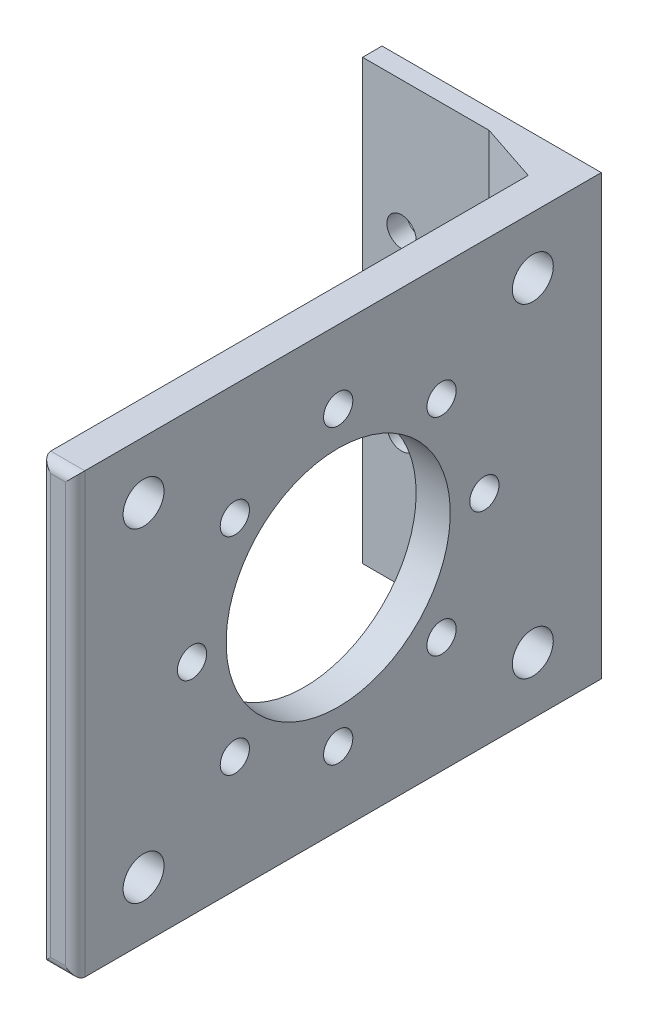
ISO-10303-21;
HEADER;
FILE_DESCRIPTION(('STEP AP214'),'2;1');
FILE_NAME('part.step','',(''),(''),'','','');
FILE_SCHEMA(('AUTOMOTIVE_DESIGN { 1 0 10303 214 1 1 1 1 }'));
ENDSEC;
DATA;
#1=APPLICATION_CONTEXT('core data for automotive mechanical design processes');
#2=APPLICATION_PROTOCOL_DEFINITION('international standard','automotive_design',2000,#1);
#3=PRODUCT_CONTEXT('',#1,'mechanical');
#4=PRODUCT('Part','Part','',(#3));
#5=PRODUCT_RELATED_PRODUCT_CATEGORY('part','',(#4));
#6=PRODUCT_DEFINITION_FORMATION('','',#4);
#7=PRODUCT_DEFINITION_CONTEXT('part definition',#1,'design');
#8=PRODUCT_DEFINITION('design','',#6,#7);
#9=PRODUCT_DEFINITION_SHAPE('','',#8);
#10=(LENGTH_UNIT() NAMED_UNIT(*) SI_UNIT(.MILLI.,.METRE.));
#11=(NAMED_UNIT(*) PLANE_ANGLE_UNIT() SI_UNIT($,.RADIAN.));
#12=(NAMED_UNIT(*) SI_UNIT($,.STERADIAN.) SOLID_ANGLE_UNIT());
#13=UNCERTAINTY_MEASURE_WITH_UNIT(LENGTH_MEASURE(1.E-05),#10,'distance_accuracy_value','');
#14=(GEOMETRIC_REPRESENTATION_CONTEXT(3) GLOBAL_UNCERTAINTY_ASSIGNED_CONTEXT((#13)) GLOBAL_UNIT_ASSIGNED_CONTEXT((#10,
#11,#12)) REPRESENTATION_CONTEXT('',''));
#15=CARTESIAN_POINT('',(0.,0.,0.));
#16=DIRECTION('',(0.,0.,1.));
#17=DIRECTION('',(1.,0.,0.));
#18=AXIS2_PLACEMENT_3D('',#15,#16,#17);
#19=CARTESIAN_POINT('',(16.,-13.5,-3.));
#20=DIRECTION('',(0.,0.,1.));
#21=DIRECTION('',(1.,0.,0.));
#22=AXIS2_PLACEMENT_3D('',#19,#20,#21);
#23=CYLINDRICAL_SURFACE('',#22,1.5);
#24=CARTESIAN_POINT('',(16.,-13.5,0.));
#25=DIRECTION('',(0.,0.,1.));
#26=DIRECTION('',(1.,0.,0.));
#27=AXIS2_PLACEMENT_3D('',#24,#25,#26);
#28=CIRCLE('',#27,1.5);
#29=CARTESIAN_POINT('',(17.5,-13.5,0.));
#30=VERTEX_POINT('',#29);
#31=EDGE_CURVE('E194',#30,#30,#28,.T.);
#32=ORIENTED_EDGE('',*,*,#31,.F.);
#33=EDGE_LOOP('',(#32));
#34=FACE_BOUND('',#33,.T.);
#35=CARTESIAN_POINT('',(16.,-13.5,1.999));
#36=DIRECTION('',(0.,0.,1.));
#37=DIRECTION('',(1.,0.,0.));
#38=AXIS2_PLACEMENT_3D('',#35,#36,#37);
#39=CIRCLE('',#38,1.5);
#40=CARTESIAN_POINT('',(17.5,-13.5,1.999));
#41=VERTEX_POINT('',#40);
#42=EDGE_CURVE('E186',#41,#41,#39,.F.);
#43=ORIENTED_EDGE('',*,*,#42,.F.);
#44=EDGE_LOOP('',(#43));
#45=FACE_BOUND('',#44,.T.);
#46=ADVANCED_FACE('F38',(#34,#45),#23,.F.);
#47=CARTESIAN_POINT('',(16.,-31.5,-3.));
#48=DIRECTION('',(0.,0.,1.));
#49=DIRECTION('',(1.,0.,0.));
#50=AXIS2_PLACEMENT_3D('',#47,#48,#49);
#51=CYLINDRICAL_SURFACE('',#50,1.5);
#52=CARTESIAN_POINT('',(16.,-31.5,0.));
#53=DIRECTION('',(0.,0.,1.));
#54=DIRECTION('',(1.,0.,0.));
#55=AXIS2_PLACEMENT_3D('',#52,#53,#54);
#56=CIRCLE('',#55,1.5);
#57=CARTESIAN_POINT('',(17.5,-31.5,0.));
#58=VERTEX_POINT('',#57);
#59=EDGE_CURVE('E179',#58,#58,#56,.T.);
#60=ORIENTED_EDGE('',*,*,#59,.F.);
#61=EDGE_LOOP('',(#60));
#62=FACE_BOUND('',#61,.T.);
#63=CARTESIAN_POINT('',(16.,-31.5,1.999));
#64=DIRECTION('',(0.,0.,1.));
#65=DIRECTION('',(1.,0.,0.));
#66=AXIS2_PLACEMENT_3D('',#63,#64,#65);
#67=CIRCLE('',#66,1.5);
#68=CARTESIAN_POINT('',(17.5,-31.5,1.999));
#69=VERTEX_POINT('',#68);
#70=EDGE_CURVE('E183',#69,#69,#67,.F.);
#71=ORIENTED_EDGE('',*,*,#70,.F.);
#72=EDGE_LOOP('',(#71));
#73=FACE_BOUND('',#72,.T.);
#74=ADVANCED_FACE('F327',(#62,#73),#51,.F.);
#75=CARTESIAN_POINT('',(0.,0.,2.));
#76=DIRECTION('',(1.,0.,0.));
#77=DIRECTION('',(0.,0.,-1.));
#78=AXIS2_PLACEMENT_3D('',#75,#76,#77);
#79=PLANE('',#78);
#80=DIRECTION('',(0.,-1.,0.));
#81=VECTOR('',#80,1.);
#82=CARTESIAN_POINT('',(0.,0.,0.));
#83=LINE('',#82,#81);
#84=CARTESIAN_POINT('',(0.,0.,0.));
#85=VERTEX_POINT('',#84);
#86=CARTESIAN_POINT('',(0.,-45.,0.));
#87=VERTEX_POINT('',#86);
#88=EDGE_CURVE('E133',#85,#87,#83,.T.);
#89=ORIENTED_EDGE('',*,*,#88,.T.);
#90=DIRECTION('',(0.,0.,-1.));
#91=VECTOR('',#90,1.);
#92=CARTESIAN_POINT('',(0.,-45.,2.));
#93=LINE('',#92,#91);
#94=CARTESIAN_POINT('',(0.,-45.,2.));
#95=VERTEX_POINT('',#94);
#96=EDGE_CURVE('E114',#95,#87,#93,.T.);
#97=ORIENTED_EDGE('',*,*,#96,.F.);
#98=DIRECTION('',(0.,-1.,0.));
#99=VECTOR('',#98,1.);
#100=CARTESIAN_POINT('',(0.,0.,2.));
#101=LINE('',#100,#99);
#102=CARTESIAN_POINT('',(0.,0.,2.));
#103=VERTEX_POINT('',#102);
#104=EDGE_CURVE('E121',#103,#95,#101,.T.);
#105=ORIENTED_EDGE('',*,*,#104,.F.);
#106=DIRECTION('',(0.,0.,-1.));
#107=VECTOR('',#106,1.);
#108=CARTESIAN_POINT('',(0.,0.,2.));
#109=LINE('',#108,#107);
#110=EDGE_CURVE('E293',#103,#85,#109,.T.);
#111=ORIENTED_EDGE('',*,*,#110,.T.);
#112=EDGE_LOOP('',(#89,#97,#105,#111));
#113=FACE_BOUND('',#112,.T.);
#114=ADVANCED_FACE('F131',(#113),#79,.F.);
#115=CARTESIAN_POINT('',(0.,-45.,2.));
#116=DIRECTION('',(0.,1.,0.));
#117=DIRECTION('',(0.,0.,1.));
#118=AXIS2_PLACEMENT_3D('',#115,#116,#117);
#119=PLANE('',#118);
#120=DIRECTION('',(0.,0.,-1.));
#121=VECTOR('',#120,1.);
#122=CARTESIAN_POINT('',(22.5,-45.,2.));
#123=LINE('',#122,#121);
#124=CARTESIAN_POINT('',(22.5,-45.,53.));
#125=VERTEX_POINT('',#124);
#126=CARTESIAN_POINT('',(22.5,-45.,0.));
#127=VERTEX_POINT('',#126);
#128=EDGE_CURVE('E135',#125,#127,#123,.T.);
#129=ORIENTED_EDGE('',*,*,#128,.F.);
#130=DIRECTION('',(1.,0.,0.));
#131=VECTOR('',#130,1.);
#132=CARTESIAN_POINT('',(0.,-45.,53.));
#133=LINE('',#132,#131);
#134=CARTESIAN_POINT('',(19.,-45.,53.));
#135=VERTEX_POINT('',#134);
#136=EDGE_CURVE('E62',#125,#135,#133,.F.);
#137=ORIENTED_EDGE('',*,*,#136,.T.);
#138=DIRECTION('',(0.,0.,-1.));
#139=VECTOR('',#138,1.);
#140=CARTESIAN_POINT('',(19.,-45.,54.));
#141=LINE('',#140,#139);
#142=CARTESIAN_POINT('',(19.,-45.,4.00000000000001));
#143=VERTEX_POINT('',#142);
#144=EDGE_CURVE('E288',#135,#143,#141,.T.);
#145=ORIENTED_EDGE('',*,*,#144,.T.);
#146=DIRECTION('',(-0.948683298050513,0.,-0.31622776601684));
#147=VECTOR('',#146,1.);
#148=CARTESIAN_POINT('',(1.30000000000003,-45.,-1.90000000000005));
#149=LINE('',#148,#147);
#150=CARTESIAN_POINT('',(13.0000000000001,-45.,2.));
#151=VERTEX_POINT('',#150);
#152=EDGE_CURVE('E117',#143,#151,#149,.T.);
#153=ORIENTED_EDGE('',*,*,#152,.T.);
#154=DIRECTION('',(1.,0.,0.));
#155=VECTOR('',#154,1.);
#156=CARTESIAN_POINT('',(0.,-45.,2.));
#157=LINE('',#156,#155);
#158=EDGE_CURVE('E109',#95,#151,#157,.T.);
#159=ORIENTED_EDGE('',*,*,#158,.F.);
#160=ORIENTED_EDGE('',*,*,#96,.T.);
#161=DIRECTION('',(1.,0.,0.));
#162=VECTOR('',#161,1.);
#163=CARTESIAN_POINT('',(0.,-45.,0.));
#164=LINE('',#163,#162);
#165=EDGE_CURVE('E295',#87,#127,#164,.T.);
#166=ORIENTED_EDGE('',*,*,#165,.T.);
#167=EDGE_LOOP('',(#129,#137,#145,#153,#159,#160,#166));
#168=FACE_BOUND('',#167,.T.);
#169=ADVANCED_FACE('F111',(#168),#119,.F.);
#170=CARTESIAN_POINT('',(22.5,0.,2.));
#171=DIRECTION('',(-1.,0.,0.));
#172=DIRECTION('',(0.,-1.,0.));
#173=AXIS2_PLACEMENT_3D('',#170,#171,#172);
#174=PLANE('',#173);
#175=CARTESIAN_POINT('',(22.5,-11.8933982822018,16.3933982822017));
#176=DIRECTION('',(1.,0.,0.));
#177=DIRECTION('',(0.,1.,0.));
#178=AXIS2_PLACEMENT_3D('',#175,#176,#177);
#179=CIRCLE('',#178,1.50000000000001);
#180=CARTESIAN_POINT('',(22.5,-10.3933982822018,16.3933982822017));
#181=VERTEX_POINT('',#180);
#182=EDGE_CURVE('E218',#181,#181,#179,.T.);
#183=ORIENTED_EDGE('',*,*,#182,.F.);
#184=EDGE_LOOP('',(#183));
#185=FACE_BOUND('',#184,.T.);
#186=CARTESIAN_POINT('',(22.5,-7.50000000000002,26.9999999999999));
#187=DIRECTION('',(1.,0.,0.));
#188=DIRECTION('',(0.,1.,0.));
#189=AXIS2_PLACEMENT_3D('',#186,#187,#188);
#190=CIRCLE('',#189,1.5);
#191=CARTESIAN_POINT('',(22.5,-6.00000000000002,26.9999999999999));
#192=VERTEX_POINT('',#191);
#193=EDGE_CURVE('E249',#192,#192,#190,.T.);
#194=ORIENTED_EDGE('',*,*,#193,.F.);
#195=EDGE_LOOP('',(#194));
#196=FACE_BOUND('',#195,.T.);
#197=CARTESIAN_POINT('',(22.5,-11.8933982822018,37.6066017177982));
#198=DIRECTION('',(1.,0.,0.));
#199=DIRECTION('',(0.,1.,0.));
#200=AXIS2_PLACEMENT_3D('',#197,#198,#199);
#201=CIRCLE('',#200,1.5);
#202=CARTESIAN_POINT('',(22.5,-10.3933982822018,37.6066017177982));
#203=VERTEX_POINT('',#202);
#204=EDGE_CURVE('E243',#203,#203,#201,.T.);
#205=ORIENTED_EDGE('',*,*,#204,.F.);
#206=EDGE_LOOP('',(#205));
#207=FACE_BOUND('',#206,.T.);
#208=CARTESIAN_POINT('',(22.5,-22.5,42.));
#209=DIRECTION('',(1.,0.,0.));
#210=DIRECTION('',(0.,1.,0.));
#211=AXIS2_PLACEMENT_3D('',#208,#209,#210);
#212=CIRCLE('',#211,1.5);
#213=CARTESIAN_POINT('',(22.5,-21.,42.));
#214=VERTEX_POINT('',#213);
#215=EDGE_CURVE('E235',#214,#214,#212,.T.);
#216=ORIENTED_EDGE('',*,*,#215,.F.);
#217=EDGE_LOOP('',(#216));
#218=FACE_BOUND('',#217,.T.);
#219=CARTESIAN_POINT('',(22.5,-39.1447943912765,7.02624673046822));
#220=DIRECTION('',(1.,0.,0.));
#221=DIRECTION('',(0.,1.,0.));
#222=AXIS2_PLACEMENT_3D('',#219,#220,#221);
#223=CIRCLE('',#222,2.1);
#224=CARTESIAN_POINT('',(22.5,-37.0447943912765,7.02624673046822));
#225=VERTEX_POINT('',#224);
#226=EDGE_CURVE('E271',#225,#225,#223,.T.);
#227=ORIENTED_EDGE('',*,*,#226,.F.);
#228=EDGE_LOOP('',(#227));
#229=FACE_BOUND('',#228,.T.);
#230=CARTESIAN_POINT('',(22.5,-22.5,27.));
#231=DIRECTION('',(1.,0.,0.));
#232=DIRECTION('',(0.,1.,0.));
#233=AXIS2_PLACEMENT_3D('',#230,#231,#232);
#234=CIRCLE('',#233,11.5);
#235=CARTESIAN_POINT('',(22.5,-11.,27.));
#236=VERTEX_POINT('',#235);
#237=EDGE_CURVE('E266',#236,#236,#234,.T.);
#238=ORIENTED_EDGE('',*,*,#237,.F.);
#239=EDGE_LOOP('',(#238));
#240=FACE_BOUND('',#239,.T.);
#241=CARTESIAN_POINT('',(22.5,-39.1447943912765,46.9737532695318));
#242=DIRECTION('',(1.,0.,0.));
#243=DIRECTION('',(0.,-1.,0.));
#244=AXIS2_PLACEMENT_3D('',#241,#242,#243);
#245=CIRCLE('',#244,2.1);
#246=CARTESIAN_POINT('',(22.5,-41.2447943912765,46.9737532695318));
#247=VERTEX_POINT('',#246);
#248=EDGE_CURVE('E259',#247,#247,#245,.T.);
#249=ORIENTED_EDGE('',*,*,#248,.F.);
#250=EDGE_LOOP('',(#249));
#251=FACE_BOUND('',#250,.T.);
#252=CARTESIAN_POINT('',(22.5,-5.85520560872354,7.02624673046822));
#253=DIRECTION('',(1.,0.,0.));
#254=DIRECTION('',(0.,-1.,0.));
#255=AXIS2_PLACEMENT_3D('',#252,#253,#254);
#256=CIRCLE('',#255,2.1);
#257=CARTESIAN_POINT('',(22.5,-7.95520560872354,7.02624673046822));
#258=VERTEX_POINT('',#257);
#259=EDGE_CURVE('E242',#258,#258,#256,.T.);
#260=ORIENTED_EDGE('',*,*,#259,.F.);
#261=EDGE_LOOP('',(#260));
#262=FACE_BOUND('',#261,.T.);
#263=CARTESIAN_POINT('',(22.5,-22.5000000000001,12.));
#264=DIRECTION('',(1.,0.,0.));
#265=DIRECTION('',(0.,1.,0.));
#266=AXIS2_PLACEMENT_3D('',#263,#264,#265);
#267=CIRCLE('',#266,1.50000000000001);
#268=CARTESIAN_POINT('',(22.5,-21.0000000000001,12.));
#269=VERTEX_POINT('',#268);
#270=EDGE_CURVE('E211',#269,#269,#267,.T.);
#271=ORIENTED_EDGE('',*,*,#270,.F.);
#272=EDGE_LOOP('',(#271));
#273=FACE_BOUND('',#272,.T.);
#274=CARTESIAN_POINT('',(22.5,-33.1066017177983,16.3933982822019));
#275=DIRECTION('',(1.,0.,0.));
#276=DIRECTION('',(0.,1.,0.));
#277=AXIS2_PLACEMENT_3D('',#274,#275,#276);
#278=CIRCLE('',#277,1.50000000000001);
#279=CARTESIAN_POINT('',(22.5,-31.6066017177983,16.3933982822019));
#280=VERTEX_POINT('',#279);
#281=EDGE_CURVE('E219',#280,#280,#278,.T.);
#282=ORIENTED_EDGE('',*,*,#281,.F.);
#283=EDGE_LOOP('',(#282));
#284=FACE_BOUND('',#283,.T.);
#285=CARTESIAN_POINT('',(22.5,-37.5,27.0000000000002));
#286=DIRECTION('',(1.,0.,0.));
#287=DIRECTION('',(0.,1.,0.));
#288=AXIS2_PLACEMENT_3D('',#285,#286,#287);
#289=CIRCLE('',#288,1.50000000000001);
#290=CARTESIAN_POINT('',(22.5,-36.,27.0000000000002));
#291=VERTEX_POINT('',#290);
#292=EDGE_CURVE('E225',#291,#291,#289,.T.);
#293=ORIENTED_EDGE('',*,*,#292,.F.);
#294=EDGE_LOOP('',(#293));
#295=FACE_BOUND('',#294,.T.);
#296=CARTESIAN_POINT('',(22.5,-33.1066017177981,37.6066017177983));
#297=DIRECTION('',(1.,0.,0.));
#298=DIRECTION('',(0.,1.,0.));
#299=AXIS2_PLACEMENT_3D('',#296,#297,#298);
#300=CIRCLE('',#299,1.5);
#301=CARTESIAN_POINT('',(22.5,-31.6066017177981,37.6066017177983));
#302=VERTEX_POINT('',#301);
#303=EDGE_CURVE('E174',#302,#302,#300,.T.);
#304=ORIENTED_EDGE('',*,*,#303,.F.);
#305=EDGE_LOOP('',(#304));
#306=FACE_BOUND('',#305,.T.);
#307=CARTESIAN_POINT('',(22.5,-5.85520560872353,46.9737532695318));
#308=DIRECTION('',(1.,0.,0.));
#309=DIRECTION('',(0.,1.,0.));
#310=AXIS2_PLACEMENT_3D('',#307,#308,#309);
#311=CIRCLE('',#310,2.1);
#312=CARTESIAN_POINT('',(22.5,-3.75520560872353,46.9737532695318));
#313=VERTEX_POINT('',#312);
#314=EDGE_CURVE('E278',#313,#313,#311,.T.);
#315=ORIENTED_EDGE('',*,*,#314,.F.);
#316=EDGE_LOOP('',(#315));
#317=FACE_BOUND('',#316,.T.);
#318=DIRECTION('',(0.,0.,-1.));
#319=VECTOR('',#318,1.);
#320=CARTESIAN_POINT('',(22.5,0.,2.));
#321=LINE('',#320,#319);
#322=CARTESIAN_POINT('',(22.5,0.,53.));
#323=VERTEX_POINT('',#322);
#324=CARTESIAN_POINT('',(22.5,0.,0.));
#325=VERTEX_POINT('',#324);
#326=EDGE_CURVE('E140',#323,#325,#321,.T.);
#327=ORIENTED_EDGE('',*,*,#326,.F.);
#328=DIRECTION('',(0.,1.,0.));
#329=VECTOR('',#328,1.);
#330=CARTESIAN_POINT('',(22.5,0.,53.));
#331=LINE('',#330,#329);
#332=EDGE_CURVE('E158',#323,#125,#331,.F.);
#333=ORIENTED_EDGE('',*,*,#332,.T.);
#334=ORIENTED_EDGE('',*,*,#128,.T.);
#335=DIRECTION('',(0.,1.,0.));
#336=VECTOR('',#335,1.);
#337=CARTESIAN_POINT('',(22.5,0.,0.));
#338=LINE('',#337,#336);
#339=EDGE_CURVE('E297',#127,#325,#338,.T.);
#340=ORIENTED_EDGE('',*,*,#339,.T.);
#341=EDGE_LOOP('',(#327,#333,#334,#340));
#342=FACE_BOUND('',#341,.T.);
#343=ADVANCED_FACE('F309',(#185,#196,#207,#218,#229,#240,#251,#262,#273,#284,#295,#306,#317,
#342),#174,.F.);
#344=CARTESIAN_POINT('',(0.,0.,2.));
#345=DIRECTION('',(0.,-1.,0.));
#346=DIRECTION('',(0.,0.,-1.));
#347=AXIS2_PLACEMENT_3D('',#344,#345,#346);
#348=PLANE('',#347);
#349=DIRECTION('',(0.,0.,-1.));
#350=VECTOR('',#349,1.);
#351=CARTESIAN_POINT('',(19.,0.,54.));
#352=LINE('',#351,#350);
#353=CARTESIAN_POINT('',(19.,0.,53.));
#354=VERTEX_POINT('',#353);
#355=CARTESIAN_POINT('',(19.,0.,4.00000000000001));
#356=VERTEX_POINT('',#355);
#357=EDGE_CURVE('E290',#354,#356,#352,.T.);
#358=ORIENTED_EDGE('',*,*,#357,.F.);
#359=DIRECTION('',(-1.,0.,0.));
#360=VECTOR('',#359,1.);
#361=CARTESIAN_POINT('',(0.,0.,53.));
#362=LINE('',#361,#360);
#363=EDGE_CURVE('E11',#354,#323,#362,.F.);
#364=ORIENTED_EDGE('',*,*,#363,.T.);
#365=ORIENTED_EDGE('',*,*,#326,.T.);
#366=DIRECTION('',(-1.,0.,0.));
#367=VECTOR('',#366,1.);
#368=CARTESIAN_POINT('',(0.,0.,0.));
#369=LINE('',#368,#367);
#370=EDGE_CURVE('E129',#325,#85,#369,.T.);
#371=ORIENTED_EDGE('',*,*,#370,.T.);
#372=ORIENTED_EDGE('',*,*,#110,.F.);
#373=DIRECTION('',(-1.,0.,0.));
#374=VECTOR('',#373,1.);
#375=CARTESIAN_POINT('',(0.,0.,2.));
#376=LINE('',#375,#374);
#377=CARTESIAN_POINT('',(13.0000000000001,0.,2.));
#378=VERTEX_POINT('',#377);
#379=EDGE_CURVE('E120',#378,#103,#376,.T.);
#380=ORIENTED_EDGE('',*,*,#379,.F.);
#381=DIRECTION('',(0.948683298050513,0.,0.31622776601684));
#382=VECTOR('',#381,1.);
#383=CARTESIAN_POINT('',(1.30000000000003,0.,-1.90000000000005));
#384=LINE('',#383,#382);
#385=EDGE_CURVE('E146',#378,#356,#384,.T.);
#386=ORIENTED_EDGE('',*,*,#385,.T.);
#387=EDGE_LOOP('',(#358,#364,#365,#371,#372,#380,#386));
#388=FACE_BOUND('',#387,.T.);
#389=ADVANCED_FACE('F303',(#388),#348,.F.);
#390=CARTESIAN_POINT('',(0.,0.,2.));
#391=DIRECTION('',(0.,0.,1.));
#392=DIRECTION('',(1.,0.,0.));
#393=AXIS2_PLACEMENT_3D('',#390,#391,#392);
#394=PLANE('',#393);
#395=CARTESIAN_POINT('',(4.,-13.5,2.));
#396=DIRECTION('',(0.,0.,1.));
#397=DIRECTION('',(1.,0.,0.));
#398=AXIS2_PLACEMENT_3D('',#395,#396,#397);
#399=CIRCLE('',#398,1.5);
#400=CARTESIAN_POINT('',(5.50000000000001,-13.5,2.));
#401=VERTEX_POINT('',#400);
#402=EDGE_CURVE('E166',#401,#401,#399,.T.);
#403=ORIENTED_EDGE('',*,*,#402,.F.);
#404=EDGE_LOOP('',(#403));
#405=FACE_BOUND('',#404,.T.);
#406=CARTESIAN_POINT('',(4.,-31.5,2.));
#407=DIRECTION('',(0.,0.,1.));
#408=DIRECTION('',(1.,0.,0.));
#409=AXIS2_PLACEMENT_3D('',#406,#407,#408);
#410=CIRCLE('',#409,1.5);
#411=CARTESIAN_POINT('',(5.50000000000001,-31.5,2.));
#412=VERTEX_POINT('',#411);
#413=EDGE_CURVE('E178',#412,#412,#410,.T.);
#414=ORIENTED_EDGE('',*,*,#413,.F.);
#415=EDGE_LOOP('',(#414));
#416=FACE_BOUND('',#415,.T.);
#417=ORIENTED_EDGE('',*,*,#158,.T.);
#418=DIRECTION('',(0.,1.,0.));
#419=VECTOR('',#418,1.);
#420=CARTESIAN_POINT('',(13.0000000000001,0.,2.));
#421=LINE('',#420,#419);
#422=EDGE_CURVE('E138',#151,#378,#421,.T.);
#423=ORIENTED_EDGE('',*,*,#422,.T.);
#424=ORIENTED_EDGE('',*,*,#379,.T.);
#425=ORIENTED_EDGE('',*,*,#104,.T.);
#426=EDGE_LOOP('',(#417,#423,#424,#425));
#427=FACE_BOUND('',#426,.T.);
#428=ADVANCED_FACE('F124',(#405,#416,#427),#394,.T.);
#429=CARTESIAN_POINT('',(0.,0.,0.));
#430=DIRECTION('',(0.,0.,1.));
#431=DIRECTION('',(1.,0.,0.));
#432=AXIS2_PLACEMENT_3D('',#429,#430,#431);
#433=PLANE('',#432);
#434=ORIENTED_EDGE('',*,*,#59,.T.);
#435=EDGE_LOOP('',(#434));
#436=FACE_BOUND('',#435,.T.);
#437=ORIENTED_EDGE('',*,*,#31,.T.);
#438=EDGE_LOOP('',(#437));
#439=FACE_BOUND('',#438,.T.);
#440=CARTESIAN_POINT('',(4.,-13.5,0.));
#441=DIRECTION('',(0.,0.,1.));
#442=DIRECTION('',(1.,0.,0.));
#443=AXIS2_PLACEMENT_3D('',#440,#441,#442);
#444=CIRCLE('',#443,1.5);
#445=CARTESIAN_POINT('',(5.50000000000001,-13.5,0.));
#446=VERTEX_POINT('',#445);
#447=EDGE_CURVE('E180',#446,#446,#444,.T.);
#448=ORIENTED_EDGE('',*,*,#447,.T.);
#449=EDGE_LOOP('',(#448));
#450=FACE_BOUND('',#449,.T.);
#451=CARTESIAN_POINT('',(4.,-31.5,0.));
#452=DIRECTION('',(0.,0.,1.));
#453=DIRECTION('',(1.,0.,0.));
#454=AXIS2_PLACEMENT_3D('',#451,#452,#453);
#455=CIRCLE('',#454,1.5);
#456=CARTESIAN_POINT('',(5.50000000000001,-31.5,0.));
#457=VERTEX_POINT('',#456);
#458=EDGE_CURVE('E175',#457,#457,#455,.T.);
#459=ORIENTED_EDGE('',*,*,#458,.T.);
#460=EDGE_LOOP('',(#459));
#461=FACE_BOUND('',#460,.T.);
#462=ORIENTED_EDGE('',*,*,#88,.F.);
#463=ORIENTED_EDGE('',*,*,#370,.F.);
#464=ORIENTED_EDGE('',*,*,#339,.F.);
#465=ORIENTED_EDGE('',*,*,#165,.F.);
#466=EDGE_LOOP('',(#462,#463,#464,#465));
#467=FACE_BOUND('',#466,.T.);
#468=ADVANCED_FACE('F311',(#436,#439,#450,#461,#467),#433,.F.);
#469=CARTESIAN_POINT('',(19.,-45.,54.));
#470=DIRECTION('',(1.,0.,0.));
#471=DIRECTION('',(0.,0.,-1.));
#472=AXIS2_PLACEMENT_3D('',#469,#470,#471);
#473=PLANE('',#472);
#474=CARTESIAN_POINT('',(19.,-11.8933982822018,16.3933982822017));
#475=DIRECTION('',(1.,0.,0.));
#476=DIRECTION('',(0.,0.,-1.));
#477=AXIS2_PLACEMENT_3D('',#474,#475,#476);
#478=CIRCLE('',#477,1.50000000000001);
#479=CARTESIAN_POINT('',(19.,-11.8933982822018,14.8933982822017));
#480=VERTEX_POINT('',#479);
#481=EDGE_CURVE('E252',#480,#480,#478,.F.);
#482=ORIENTED_EDGE('',*,*,#481,.F.);
#483=EDGE_LOOP('',(#482));
#484=FACE_BOUND('',#483,.T.);
#485=CARTESIAN_POINT('',(19.,-7.50000000000002,26.9999999999999));
#486=DIRECTION('',(1.,0.,0.));
#487=DIRECTION('',(0.,0.,-1.));
#488=AXIS2_PLACEMENT_3D('',#485,#486,#487);
#489=CIRCLE('',#488,1.5);
#490=CARTESIAN_POINT('',(19.,-7.50000000000002,25.4999999999999));
#491=VERTEX_POINT('',#490);
#492=EDGE_CURVE('E246',#491,#491,#489,.F.);
#493=ORIENTED_EDGE('',*,*,#492,.F.);
#494=EDGE_LOOP('',(#493));
#495=FACE_BOUND('',#494,.T.);
#496=CARTESIAN_POINT('',(19.,-11.8933982822018,37.6066017177982));
#497=DIRECTION('',(1.,0.,0.));
#498=DIRECTION('',(0.,0.,-1.));
#499=AXIS2_PLACEMENT_3D('',#496,#497,#498);
#500=CIRCLE('',#499,1.5);
#501=CARTESIAN_POINT('',(19.,-11.8933982822018,36.1066017177982));
#502=VERTEX_POINT('',#501);
#503=EDGE_CURVE('E239',#502,#502,#500,.F.);
#504=ORIENTED_EDGE('',*,*,#503,.F.);
#505=EDGE_LOOP('',(#504));
#506=FACE_BOUND('',#505,.T.);
#507=CARTESIAN_POINT('',(19.,-22.5,42.));
#508=DIRECTION('',(1.,0.,0.));
#509=DIRECTION('',(0.,0.,-1.));
#510=AXIS2_PLACEMENT_3D('',#507,#508,#509);
#511=CIRCLE('',#510,1.5);
#512=CARTESIAN_POINT('',(19.,-22.5,40.5));
#513=VERTEX_POINT('',#512);
#514=EDGE_CURVE('E238',#513,#513,#511,.F.);
#515=ORIENTED_EDGE('',*,*,#514,.F.);
#516=EDGE_LOOP('',(#515));
#517=FACE_BOUND('',#516,.T.);
#518=CARTESIAN_POINT('',(19.,-39.1447943912765,7.02624673046822));
#519=DIRECTION('',(1.,0.,0.));
#520=DIRECTION('',(0.,0.,-1.));
#521=AXIS2_PLACEMENT_3D('',#518,#519,#520);
#522=CIRCLE('',#521,2.1);
#523=CARTESIAN_POINT('',(19.,-39.1447943912765,4.92624673046822));
#524=VERTEX_POINT('',#523);
#525=EDGE_CURVE('E274',#524,#524,#522,.F.);
#526=ORIENTED_EDGE('',*,*,#525,.F.);
#527=EDGE_LOOP('',(#526));
#528=FACE_BOUND('',#527,.T.);
#529=CARTESIAN_POINT('',(19.,-22.5,27.));
#530=DIRECTION('',(1.,0.,0.));
#531=DIRECTION('',(0.,0.,-1.));
#532=AXIS2_PLACEMENT_3D('',#529,#530,#531);
#533=CIRCLE('',#532,11.5);
#534=CARTESIAN_POINT('',(19.,-22.5,15.5));
#535=VERTEX_POINT('',#534);
#536=EDGE_CURVE('E275',#535,#535,#533,.F.);
#537=ORIENTED_EDGE('',*,*,#536,.F.);
#538=EDGE_LOOP('',(#537));
#539=FACE_BOUND('',#538,.T.);
#540=CARTESIAN_POINT('',(19.,-39.1447943912765,46.9737532695318));
#541=DIRECTION('',(1.,0.,0.));
#542=DIRECTION('',(0.,0.,-1.));
#543=AXIS2_PLACEMENT_3D('',#540,#541,#542);
#544=CIRCLE('',#543,2.1);
#545=CARTESIAN_POINT('',(19.,-39.1447943912765,44.8737532695318));
#546=VERTEX_POINT('',#545);
#547=EDGE_CURVE('E262',#546,#546,#544,.F.);
#548=ORIENTED_EDGE('',*,*,#547,.F.);
#549=EDGE_LOOP('',(#548));
#550=FACE_BOUND('',#549,.T.);
#551=CARTESIAN_POINT('',(19.,-5.85520560872354,7.02624673046822));
#552=DIRECTION('',(1.,0.,0.));
#553=DIRECTION('',(0.,0.,-1.));
#554=AXIS2_PLACEMENT_3D('',#551,#552,#553);
#555=CIRCLE('',#554,2.1);
#556=CARTESIAN_POINT('',(19.,-5.85520560872354,4.92624673046822));
#557=VERTEX_POINT('',#556);
#558=EDGE_CURVE('E263',#557,#557,#555,.F.);
#559=ORIENTED_EDGE('',*,*,#558,.F.);
#560=EDGE_LOOP('',(#559));
#561=FACE_BOUND('',#560,.T.);
#562=CARTESIAN_POINT('',(19.,-22.5000000000001,12.));
#563=DIRECTION('',(1.,0.,0.));
#564=DIRECTION('',(0.,0.,-1.));
#565=AXIS2_PLACEMENT_3D('',#562,#563,#564);
#566=CIRCLE('',#565,1.50000000000001);
#567=CARTESIAN_POINT('',(19.,-22.5000000000001,10.5));
#568=VERTEX_POINT('',#567);
#569=EDGE_CURVE('E214',#568,#568,#566,.F.);
#570=ORIENTED_EDGE('',*,*,#569,.F.);
#571=EDGE_LOOP('',(#570));
#572=FACE_BOUND('',#571,.T.);
#573=CARTESIAN_POINT('',(19.,-33.1066017177983,16.3933982822019));
#574=DIRECTION('',(1.,0.,0.));
#575=DIRECTION('',(0.,0.,-1.));
#576=AXIS2_PLACEMENT_3D('',#573,#574,#575);
#577=CIRCLE('',#576,1.50000000000001);
#578=CARTESIAN_POINT('',(19.,-33.1066017177983,14.8933982822019));
#579=VERTEX_POINT('',#578);
#580=EDGE_CURVE('E215',#579,#579,#577,.F.);
#581=ORIENTED_EDGE('',*,*,#580,.F.);
#582=EDGE_LOOP('',(#581));
#583=FACE_BOUND('',#582,.T.);
#584=CARTESIAN_POINT('',(19.,-37.5,27.0000000000002));
#585=DIRECTION('',(1.,0.,0.));
#586=DIRECTION('',(0.,0.,-1.));
#587=AXIS2_PLACEMENT_3D('',#584,#585,#586);
#588=CIRCLE('',#587,1.50000000000001);
#589=CARTESIAN_POINT('',(19.,-37.5,25.5000000000001));
#590=VERTEX_POINT('',#589);
#591=EDGE_CURVE('E222',#590,#590,#588,.F.);
#592=ORIENTED_EDGE('',*,*,#591,.F.);
#593=EDGE_LOOP('',(#592));
#594=FACE_BOUND('',#593,.T.);
#595=CARTESIAN_POINT('',(19.,-33.1066017177981,37.6066017177983));
#596=DIRECTION('',(1.,0.,0.));
#597=DIRECTION('',(0.,0.,-1.));
#598=AXIS2_PLACEMENT_3D('',#595,#596,#597);
#599=CIRCLE('',#598,1.5);
#600=CARTESIAN_POINT('',(19.,-33.1066017177981,36.1066017177983));
#601=VERTEX_POINT('',#600);
#602=EDGE_CURVE('E228',#601,#601,#599,.F.);
#603=ORIENTED_EDGE('',*,*,#602,.F.);
#604=EDGE_LOOP('',(#603));
#605=FACE_BOUND('',#604,.T.);
#606=CARTESIAN_POINT('',(19.,-5.85520560872353,46.9737532695318));
#607=DIRECTION('',(1.,0.,0.));
#608=DIRECTION('',(0.,0.,-1.));
#609=AXIS2_PLACEMENT_3D('',#606,#607,#608);
#610=CIRCLE('',#609,2.1);
#611=CARTESIAN_POINT('',(19.,-5.85520560872353,44.8737532695318));
#612=VERTEX_POINT('',#611);
#613=EDGE_CURVE('E285',#612,#612,#610,.F.);
#614=ORIENTED_EDGE('',*,*,#613,.F.);
#615=EDGE_LOOP('',(#614));
#616=FACE_BOUND('',#615,.T.);
#617=ORIENTED_EDGE('',*,*,#144,.F.);
#618=DIRECTION('',(0.,-1.,0.));
#619=VECTOR('',#618,1.);
#620=CARTESIAN_POINT('',(19.,-45.,53.));
#621=LINE('',#620,#619);
#622=EDGE_CURVE('E47',#135,#354,#621,.F.);
#623=ORIENTED_EDGE('',*,*,#622,.T.);
#624=ORIENTED_EDGE('',*,*,#357,.T.);
#625=DIRECTION('',(0.,-1.,0.));
#626=VECTOR('',#625,1.);
#627=CARTESIAN_POINT('',(19.,-45.,4.));
#628=LINE('',#627,#626);
#629=EDGE_CURVE('E134',#356,#143,#628,.T.);
#630=ORIENTED_EDGE('',*,*,#629,.T.);
#631=EDGE_LOOP('',(#617,#623,#624,#630));
#632=FACE_BOUND('',#631,.T.);
#633=ADVANCED_FACE('F313',(#484,#495,#506,#517,#528,#539,#550,#561,#572,#583,#594,#605,#616,
#632),#473,.F.);
#634=CARTESIAN_POINT('',(0.,0.,54.));
#635=DIRECTION('',(0.,0.,-1.));
#636=DIRECTION('',(-1.,0.,0.));
#637=AXIS2_PLACEMENT_3D('',#634,#635,#636);
#638=PLANE('',#637);
#639=DIRECTION('',(1.,0.,0.));
#640=VECTOR('',#639,1.);
#641=CARTESIAN_POINT('',(0.,-44.,54.));
#642=LINE('',#641,#640);
#643=CARTESIAN_POINT('',(20.,-44.,54.));
#644=VERTEX_POINT('',#643);
#645=CARTESIAN_POINT('',(21.5,-44.,54.));
#646=VERTEX_POINT('',#645);
#647=EDGE_CURVE('E153',#644,#646,#642,.T.);
#648=ORIENTED_EDGE('',*,*,#647,.T.);
#649=DIRECTION('',(0.,1.,0.));
#650=VECTOR('',#649,1.);
#651=CARTESIAN_POINT('',(21.5,0.,54.));
#652=LINE('',#651,#650);
#653=CARTESIAN_POINT('',(21.5,-1.,54.));
#654=VERTEX_POINT('',#653);
#655=EDGE_CURVE('E155',#646,#654,#652,.T.);
#656=ORIENTED_EDGE('',*,*,#655,.T.);
#657=DIRECTION('',(-1.,0.,0.));
#658=VECTOR('',#657,1.);
#659=CARTESIAN_POINT('',(0.,-1.,54.));
#660=LINE('',#659,#658);
#661=CARTESIAN_POINT('',(20.,-1.,54.));
#662=VERTEX_POINT('',#661);
#663=EDGE_CURVE('E149',#654,#662,#660,.T.);
#664=ORIENTED_EDGE('',*,*,#663,.T.);
#665=DIRECTION('',(0.,-1.,0.));
#666=VECTOR('',#665,1.);
#667=CARTESIAN_POINT('',(20.,0.,54.));
#668=LINE('',#667,#666);
#669=EDGE_CURVE('E151',#662,#644,#668,.T.);
#670=ORIENTED_EDGE('',*,*,#669,.T.);
#671=EDGE_LOOP('',(#648,#656,#664,#670));
#672=FACE_BOUND('',#671,.T.);
#673=ADVANCED_FACE('F320',(#672),#638,.F.);
#674=CARTESIAN_POINT('',(-0.00100000000000794,-5.85520560872353,46.9737532695318));
#675=DIRECTION('',(1.,0.,0.));
#676=DIRECTION('',(0.,1.,0.));
#677=AXIS2_PLACEMENT_3D('',#674,#675,#676);
#678=CYLINDRICAL_SURFACE('',#677,2.1);
#679=ORIENTED_EDGE('',*,*,#314,.T.);
#680=EDGE_LOOP('',(#679));
#681=FACE_BOUND('',#680,.T.);
#682=ORIENTED_EDGE('',*,*,#613,.T.);
#683=EDGE_LOOP('',(#682));
#684=FACE_BOUND('',#683,.T.);
#685=ADVANCED_FACE('F361',(#681,#684),#678,.F.);
#686=CARTESIAN_POINT('',(-0.00100000000000447,-33.1066017177981,37.6066017177983));
#687=DIRECTION('',(1.,0.,0.));
#688=DIRECTION('',(0.,1.,0.));
#689=AXIS2_PLACEMENT_3D('',#686,#687,#688);
#690=CYLINDRICAL_SURFACE('',#689,1.5);
#691=ORIENTED_EDGE('',*,*,#303,.T.);
#692=EDGE_LOOP('',(#691));
#693=FACE_BOUND('',#692,.T.);
#694=ORIENTED_EDGE('',*,*,#602,.T.);
#695=EDGE_LOOP('',(#694));
#696=FACE_BOUND('',#695,.T.);
#697=ADVANCED_FACE('F357',(#693,#696),#690,.F.);
#698=CARTESIAN_POINT('',(-0.001000000000001,-37.5,27.0000000000002));
#699=DIRECTION('',(1.,0.,0.));
#700=DIRECTION('',(0.,1.,0.));
#701=AXIS2_PLACEMENT_3D('',#698,#699,#700);
#702=CYLINDRICAL_SURFACE('',#701,1.50000000000001);
#703=ORIENTED_EDGE('',*,*,#292,.T.);
#704=EDGE_LOOP('',(#703));
#705=FACE_BOUND('',#704,.T.);
#706=ORIENTED_EDGE('',*,*,#591,.T.);
#707=EDGE_LOOP('',(#706));
#708=FACE_BOUND('',#707,.T.);
#709=ADVANCED_FACE('F353',(#705,#708),#702,.F.);
#710=CARTESIAN_POINT('',(-0.00100000000000447,-33.1066017177983,16.3933982822019));
#711=DIRECTION('',(1.,0.,0.));
#712=DIRECTION('',(0.,1.,0.));
#713=AXIS2_PLACEMENT_3D('',#710,#711,#712);
#714=CYLINDRICAL_SURFACE('',#713,1.50000000000001);
#715=ORIENTED_EDGE('',*,*,#281,.T.);
#716=EDGE_LOOP('',(#715));
#717=FACE_BOUND('',#716,.T.);
#718=ORIENTED_EDGE('',*,*,#580,.T.);
#719=EDGE_LOOP('',(#718));
#720=FACE_BOUND('',#719,.T.);
#721=ADVANCED_FACE('F349',(#717,#720),#714,.F.);
#722=CARTESIAN_POINT('',(-0.00100000000000447,-22.5000000000001,12.));
#723=DIRECTION('',(1.,0.,0.));
#724=DIRECTION('',(0.,1.,0.));
#725=AXIS2_PLACEMENT_3D('',#722,#723,#724);
#726=CYLINDRICAL_SURFACE('',#725,1.50000000000001);
#727=ORIENTED_EDGE('',*,*,#270,.T.);
#728=EDGE_LOOP('',(#727));
#729=FACE_BOUND('',#728,.T.);
#730=ORIENTED_EDGE('',*,*,#569,.T.);
#731=EDGE_LOOP('',(#730));
#732=FACE_BOUND('',#731,.T.);
#733=ADVANCED_FACE('F345',(#729,#732),#726,.F.);
#734=CARTESIAN_POINT('',(-0.00100000000000794,-5.85520560872355,7.02624673046822));
#735=DIRECTION('',(1.,0.,0.));
#736=DIRECTION('',(0.,1.,0.));
#737=AXIS2_PLACEMENT_3D('',#734,#735,#736);
#738=CYLINDRICAL_SURFACE('',#737,2.1);
#739=ORIENTED_EDGE('',*,*,#259,.T.);
#740=EDGE_LOOP('',(#739));
#741=FACE_BOUND('',#740,.T.);
#742=ORIENTED_EDGE('',*,*,#558,.T.);
#743=EDGE_LOOP('',(#742));
#744=FACE_BOUND('',#743,.T.);
#745=ADVANCED_FACE('F348',(#741,#744),#738,.F.);
#746=CARTESIAN_POINT('',(-0.001000000000001,-39.1447943912765,46.9737532695318));
#747=DIRECTION('',(1.,0.,0.));
#748=DIRECTION('',(0.,1.,0.));
#749=AXIS2_PLACEMENT_3D('',#746,#747,#748);
#750=CYLINDRICAL_SURFACE('',#749,2.1);
#751=ORIENTED_EDGE('',*,*,#248,.T.);
#752=EDGE_LOOP('',(#751));
#753=FACE_BOUND('',#752,.T.);
#754=ORIENTED_EDGE('',*,*,#547,.T.);
#755=EDGE_LOOP('',(#754));
#756=FACE_BOUND('',#755,.T.);
#757=ADVANCED_FACE('F381',(#753,#756),#750,.F.);
#758=CARTESIAN_POINT('',(-0.00100000000000447,-22.5,27.));
#759=DIRECTION('',(1.,0.,0.));
#760=DIRECTION('',(0.,1.,0.));
#761=AXIS2_PLACEMENT_3D('',#758,#759,#760);
#762=CYLINDRICAL_SURFACE('',#761,11.5);
#763=ORIENTED_EDGE('',*,*,#237,.T.);
#764=EDGE_LOOP('',(#763));
#765=FACE_BOUND('',#764,.T.);
#766=ORIENTED_EDGE('',*,*,#536,.T.);
#767=EDGE_LOOP('',(#766));
#768=FACE_BOUND('',#767,.T.);
#769=ADVANCED_FACE('F384',(#765,#768),#762,.F.);
#770=CARTESIAN_POINT('',(-0.001000000000001,-39.1447943912765,7.02624673046822));
#771=DIRECTION('',(1.,0.,0.));
#772=DIRECTION('',(0.,1.,0.));
#773=AXIS2_PLACEMENT_3D('',#770,#771,#772);
#774=CYLINDRICAL_SURFACE('',#773,2.1);
#775=ORIENTED_EDGE('',*,*,#226,.T.);
#776=EDGE_LOOP('',(#775));
#777=FACE_BOUND('',#776,.T.);
#778=ORIENTED_EDGE('',*,*,#525,.T.);
#779=EDGE_LOOP('',(#778));
#780=FACE_BOUND('',#779,.T.);
#781=ADVANCED_FACE('F367',(#777,#780),#774,.F.);
#782=CARTESIAN_POINT('',(-0.00100000000000447,-22.5,42.));
#783=DIRECTION('',(1.,0.,0.));
#784=DIRECTION('',(0.,1.,0.));
#785=AXIS2_PLACEMENT_3D('',#782,#783,#784);
#786=CYLINDRICAL_SURFACE('',#785,1.5);
#787=ORIENTED_EDGE('',*,*,#215,.T.);
#788=EDGE_LOOP('',(#787));
#789=FACE_BOUND('',#788,.T.);
#790=ORIENTED_EDGE('',*,*,#514,.T.);
#791=EDGE_LOOP('',(#790));
#792=FACE_BOUND('',#791,.T.);
#793=ADVANCED_FACE('F363',(#789,#792),#786,.F.);
#794=CARTESIAN_POINT('',(-0.00100000000000447,-11.8933982822018,37.6066017177982));
#795=DIRECTION('',(1.,0.,0.));
#796=DIRECTION('',(0.,1.,0.));
#797=AXIS2_PLACEMENT_3D('',#794,#795,#796);
#798=CYLINDRICAL_SURFACE('',#797,1.5);
#799=ORIENTED_EDGE('',*,*,#204,.T.);
#800=EDGE_LOOP('',(#799));
#801=FACE_BOUND('',#800,.T.);
#802=ORIENTED_EDGE('',*,*,#503,.T.);
#803=EDGE_LOOP('',(#802));
#804=FACE_BOUND('',#803,.T.);
#805=ADVANCED_FACE('F366',(#801,#804),#798,.F.);
#806=CARTESIAN_POINT('',(-0.00100000000000794,-7.50000000000003,26.9999999999999));
#807=DIRECTION('',(1.,0.,0.));
#808=DIRECTION('',(0.,1.,0.));
#809=AXIS2_PLACEMENT_3D('',#806,#807,#808);
#810=CYLINDRICAL_SURFACE('',#809,1.5);
#811=ORIENTED_EDGE('',*,*,#193,.T.);
#812=EDGE_LOOP('',(#811));
#813=FACE_BOUND('',#812,.T.);
#814=ORIENTED_EDGE('',*,*,#492,.T.);
#815=EDGE_LOOP('',(#814));
#816=FACE_BOUND('',#815,.T.);
#817=ADVANCED_FACE('F371',(#813,#816),#810,.F.);
#818=CARTESIAN_POINT('',(-0.00100000000000447,-11.8933982822019,16.3933982822017));
#819=DIRECTION('',(1.,0.,0.));
#820=DIRECTION('',(0.,1.,0.));
#821=AXIS2_PLACEMENT_3D('',#818,#819,#820);
#822=CYLINDRICAL_SURFACE('',#821,1.50000000000001);
#823=ORIENTED_EDGE('',*,*,#182,.T.);
#824=EDGE_LOOP('',(#823));
#825=FACE_BOUND('',#824,.T.);
#826=ORIENTED_EDGE('',*,*,#481,.T.);
#827=EDGE_LOOP('',(#826));
#828=FACE_BOUND('',#827,.T.);
#829=ADVANCED_FACE('F375',(#825,#828),#822,.F.);
#830=CARTESIAN_POINT('',(19.,-45.,4.));
#831=DIRECTION('',(0.31622776601684,0.,-0.948683298050513));
#832=DIRECTION('',(0.,-1.,0.));
#833=AXIS2_PLACEMENT_3D('',#830,#831,#832);
#834=PLANE('',#833);
#835=CARTESIAN_POINT('',(16.,-13.5,2.99999999999999));
#836=DIRECTION('',(0.31622776601684,0.,-0.948683298050513));
#837=DIRECTION('',(-0.948683298050513,0.,-0.31622776601684));
#838=AXIS2_PLACEMENT_3D('',#835,#836,#837);
#839=ELLIPSE('',#838,2.3686875949336,2.24713435961294);
#840=CARTESIAN_POINT('',(13.7528656403871,-13.5,2.25095521346233));
#841=VERTEX_POINT('',#840);
#842=EDGE_CURVE('E42',#841,#841,#839,.F.);
#843=ORIENTED_EDGE('',*,*,#842,.F.);
#844=EDGE_LOOP('',(#843));
#845=FACE_BOUND('',#844,.T.);
#846=CARTESIAN_POINT('',(16.,-31.5,2.99999999999999));
#847=DIRECTION('',(0.31622776601684,0.,-0.948683298050513));
#848=DIRECTION('',(-0.948683298050513,0.,-0.31622776601684));
#849=AXIS2_PLACEMENT_3D('',#846,#847,#848);
#850=ELLIPSE('',#849,2.3686875949336,2.24713435961294);
#851=CARTESIAN_POINT('',(13.7528656403871,-31.5,2.25095521346233));
#852=VERTEX_POINT('',#851);
#853=EDGE_CURVE('E189',#852,#852,#850,.F.);
#854=ORIENTED_EDGE('',*,*,#853,.F.);
#855=EDGE_LOOP('',(#854));
#856=FACE_BOUND('',#855,.T.);
#857=ORIENTED_EDGE('',*,*,#385,.F.);
#858=ORIENTED_EDGE('',*,*,#422,.F.);
#859=ORIENTED_EDGE('',*,*,#152,.F.);
#860=ORIENTED_EDGE('',*,*,#629,.F.);
#861=EDGE_LOOP('',(#857,#858,#859,#860));
#862=FACE_BOUND('',#861,.T.);
#863=ADVANCED_FACE('F379',(#845,#856,#862),#834,.F.);
#864=CARTESIAN_POINT('',(20.,0.,53.));
#865=DIRECTION('',(0.,-1.,0.));
#866=DIRECTION('',(0.,0.,-1.));
#867=AXIS2_PLACEMENT_3D('',#864,#865,#866);
#868=CYLINDRICAL_SURFACE('',#867,1.);
#869=CARTESIAN_POINT('',(20.,-1.,53.));
#870=DIRECTION('',(-0.707106781186547,-0.707106781186547,0.));
#871=DIRECTION('',(-0.707106781186547,0.707106781186547,0.));
#872=AXIS2_PLACEMENT_3D('',#869,#870,#871);
#873=ELLIPSE('',#872,1.41421356237309,1.);
#874=EDGE_CURVE('E168',#354,#662,#873,.F.);
#875=ORIENTED_EDGE('',*,*,#874,.F.);
#876=ORIENTED_EDGE('',*,*,#622,.F.);
#877=CARTESIAN_POINT('',(20.,-44.,53.));
#878=DIRECTION('',(0.707106781186547,-0.707106781186547,0.));
#879=DIRECTION('',(-0.707106781186547,-0.707106781186547,0.));
#880=AXIS2_PLACEMENT_3D('',#877,#878,#879);
#881=ELLIPSE('',#880,1.41421356237309,1.);
#882=EDGE_CURVE('E171',#644,#135,#881,.T.);
#883=ORIENTED_EDGE('',*,*,#882,.F.);
#884=ORIENTED_EDGE('',*,*,#669,.F.);
#885=EDGE_LOOP('',(#875,#876,#883,#884));
#886=FACE_BOUND('',#885,.T.);
#887=ADVANCED_FACE('F40',(#886),#868,.T.);
#888=CARTESIAN_POINT('',(0.,-44.,53.));
#889=DIRECTION('',(1.,0.,0.));
#890=DIRECTION('',(0.,0.,-1.));
#891=AXIS2_PLACEMENT_3D('',#888,#889,#890);
#892=CYLINDRICAL_SURFACE('',#891,1.);
#893=ORIENTED_EDGE('',*,*,#882,.T.);
#894=ORIENTED_EDGE('',*,*,#136,.F.);
#895=CARTESIAN_POINT('',(21.5,-44.,53.));
#896=DIRECTION('',(0.707106781186547,0.707106781186548,0.));
#897=DIRECTION('',(0.707106781186548,-0.707106781186547,0.));
#898=AXIS2_PLACEMENT_3D('',#895,#896,#897);
#899=ELLIPSE('',#898,1.4142135623731,1.);
#900=EDGE_CURVE('E165',#646,#125,#899,.T.);
#901=ORIENTED_EDGE('',*,*,#900,.F.);
#902=ORIENTED_EDGE('',*,*,#647,.F.);
#903=EDGE_LOOP('',(#893,#894,#901,#902));
#904=FACE_BOUND('',#903,.T.);
#905=ADVANCED_FACE('F408',(#904),#892,.T.);
#906=CARTESIAN_POINT('',(0.,-1.,53.));
#907=DIRECTION('',(-1.,0.,0.));
#908=DIRECTION('',(0.,0.,1.));
#909=AXIS2_PLACEMENT_3D('',#906,#907,#908);
#910=CYLINDRICAL_SURFACE('',#909,1.);
#911=ORIENTED_EDGE('',*,*,#874,.T.);
#912=ORIENTED_EDGE('',*,*,#663,.F.);
#913=CARTESIAN_POINT('',(21.5,-1.,53.));
#914=DIRECTION('',(-0.707106781186548,0.707106781186547,0.));
#915=DIRECTION('',(-0.707106781186547,-0.707106781186548,0.));
#916=AXIS2_PLACEMENT_3D('',#913,#914,#915);
#917=ELLIPSE('',#916,1.41421356237309,1.);
#918=EDGE_CURVE('E163',#323,#654,#917,.F.);
#919=ORIENTED_EDGE('',*,*,#918,.F.);
#920=ORIENTED_EDGE('',*,*,#363,.F.);
#921=EDGE_LOOP('',(#911,#912,#919,#920));
#922=FACE_BOUND('',#921,.T.);
#923=ADVANCED_FACE('F413',(#922),#910,.T.);
#924=CARTESIAN_POINT('',(21.5,0.,53.));
#925=DIRECTION('',(0.,1.,0.));
#926=DIRECTION('',(-1.,0.,0.));
#927=AXIS2_PLACEMENT_3D('',#924,#925,#926);
#928=CYLINDRICAL_SURFACE('',#927,1.);
#929=ORIENTED_EDGE('',*,*,#900,.T.);
#930=ORIENTED_EDGE('',*,*,#332,.F.);
#931=ORIENTED_EDGE('',*,*,#918,.T.);
#932=ORIENTED_EDGE('',*,*,#655,.F.);
#933=EDGE_LOOP('',(#929,#930,#931,#932));
#934=FACE_BOUND('',#933,.T.);
#935=ADVANCED_FACE('F343',(#934),#928,.T.);
#936=CARTESIAN_POINT('',(4.,-31.5,-3.));
#937=DIRECTION('',(0.,0.,1.));
#938=DIRECTION('',(1.,0.,0.));
#939=AXIS2_PLACEMENT_3D('',#936,#937,#938);
#940=CYLINDRICAL_SURFACE('',#939,1.5);
#941=ORIENTED_EDGE('',*,*,#413,.T.);
#942=EDGE_LOOP('',(#941));
#943=FACE_BOUND('',#942,.T.);
#944=ORIENTED_EDGE('',*,*,#458,.F.);
#945=EDGE_LOOP('',(#944));
#946=FACE_BOUND('',#945,.T.);
#947=ADVANCED_FACE('F340',(#943,#946),#940,.F.);
#948=CARTESIAN_POINT('',(4.,-13.5,-3.));
#949=DIRECTION('',(0.,0.,1.));
#950=DIRECTION('',(1.,0.,0.));
#951=AXIS2_PLACEMENT_3D('',#948,#949,#950);
#952=CYLINDRICAL_SURFACE('',#951,1.5);
#953=ORIENTED_EDGE('',*,*,#402,.T.);
#954=EDGE_LOOP('',(#953));
#955=FACE_BOUND('',#954,.T.);
#956=ORIENTED_EDGE('',*,*,#447,.F.);
#957=EDGE_LOOP('',(#956));
#958=FACE_BOUND('',#957,.T.);
#959=ADVANCED_FACE('F337',(#955,#958),#952,.F.);
#960=CARTESIAN_POINT('',(16.,-31.5,17.));
#961=DIRECTION('',(0.,0.,-1.));
#962=DIRECTION('',(-1.,0.,0.));
#963=AXIS2_PLACEMENT_3D('',#960,#961,#962);
#964=CYLINDRICAL_SURFACE('',#963,2.24713435961294);
#965=CARTESIAN_POINT('',(16.,-31.5,1.999));
#966=DIRECTION('',(0.,0.,1.));
#967=DIRECTION('',(1.,0.,0.));
#968=AXIS2_PLACEMENT_3D('',#965,#966,#967);
#969=CIRCLE('',#968,2.24713435961294);
#970=CARTESIAN_POINT('',(18.2471343596129,-31.5,1.999));
#971=VERTEX_POINT('',#970);
#972=EDGE_CURVE('E204',#971,#971,#969,.T.);
#973=ORIENTED_EDGE('',*,*,#972,.F.);
#974=EDGE_LOOP('',(#973));
#975=FACE_BOUND('',#974,.T.);
#976=ORIENTED_EDGE('',*,*,#853,.T.);
#977=EDGE_LOOP('',(#976));
#978=FACE_BOUND('',#977,.T.);
#979=ADVANCED_FACE('F451',(#975,#978),#964,.F.);
#980=CARTESIAN_POINT('',(16.,-31.5,1.999));
#981=DIRECTION('',(0.,0.,1.));
#982=DIRECTION('',(1.,0.,0.));
#983=AXIS2_PLACEMENT_3D('',#980,#981,#982);
#984=PLANE('',#983);
#985=ORIENTED_EDGE('',*,*,#972,.T.);
#986=EDGE_LOOP('',(#985));
#987=FACE_BOUND('',#986,.T.);
#988=ORIENTED_EDGE('',*,*,#70,.T.);
#989=EDGE_LOOP('',(#988));
#990=FACE_BOUND('',#989,.T.);
#991=ADVANCED_FACE('F458',(#987,#990),#984,.T.);
#992=CARTESIAN_POINT('',(16.,-13.5,17.));
#993=DIRECTION('',(0.,0.,-1.));
#994=DIRECTION('',(-1.,0.,0.));
#995=AXIS2_PLACEMENT_3D('',#992,#993,#994);
#996=CYLINDRICAL_SURFACE('',#995,2.24713435961294);
#997=CARTESIAN_POINT('',(16.,-13.5,1.999));
#998=DIRECTION('',(0.,0.,1.));
#999=DIRECTION('',(1.,0.,0.));
#1000=AXIS2_PLACEMENT_3D('',#997,#998,#999);
#1001=CIRCLE('',#1000,2.24713435961294);
#1002=CARTESIAN_POINT('',(18.2471343596129,-13.5,1.999));
#1003=VERTEX_POINT('',#1002);
#1004=EDGE_CURVE('E187',#1003,#1003,#1001,.T.);
#1005=ORIENTED_EDGE('',*,*,#1004,.F.);
#1006=EDGE_LOOP('',(#1005));
#1007=FACE_BOUND('',#1006,.T.);
#1008=ORIENTED_EDGE('',*,*,#842,.T.);
#1009=EDGE_LOOP('',(#1008));
#1010=FACE_BOUND('',#1009,.T.);
#1011=ADVANCED_FACE('F465',(#1007,#1010),#996,.F.);
#1012=CARTESIAN_POINT('',(16.,-13.5,1.999));
#1013=DIRECTION('',(0.,0.,1.));
#1014=DIRECTION('',(1.,0.,0.));
#1015=AXIS2_PLACEMENT_3D('',#1012,#1013,#1014);
#1016=PLANE('',#1015);
#1017=ORIENTED_EDGE('',*,*,#1004,.T.);
#1018=EDGE_LOOP('',(#1017));
#1019=FACE_BOUND('',#1018,.T.);
#1020=ORIENTED_EDGE('',*,*,#42,.T.);
#1021=EDGE_LOOP('',(#1020));
#1022=FACE_BOUND('',#1021,.T.);
#1023=ADVANCED_FACE('F473',(#1019,#1022),#1016,.T.);
#1024=CLOSED_SHELL('',(#46,#74,#114,#169,#343,#389,#428,#468,#633,#673,#685,#697,#709,#721,#733,
#745,#757,#769,#781,#793,#805,#817,#829,#863,#887,#905,#923,#935,#947,#959,#979,#991,#1011,#1023));
#1025=MANIFOLD_SOLID_BREP('B2',#1024);
#1026=ADVANCED_BREP_SHAPE_REPRESENTATION('',(#18,#1025),#14);
#1027=SHAPE_DEFINITION_REPRESENTATION(#9,#1026);
ENDSEC;
END-ISO-10303-21;
